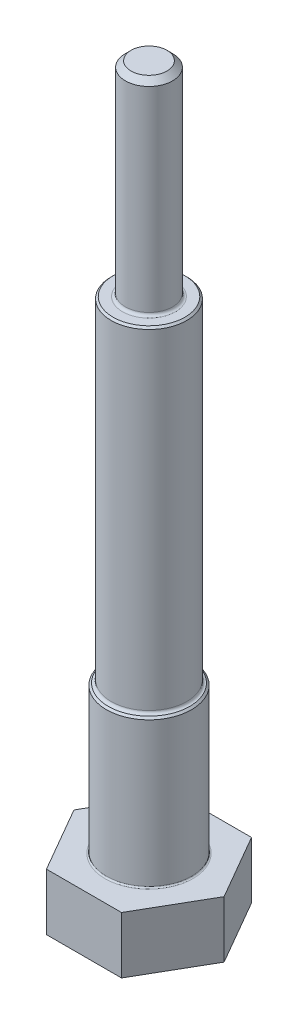
ISO-10303-21;
HEADER;
FILE_DESCRIPTION(('STEP AP214'),'2;1');
FILE_NAME('part.step','',(''),(''),'','','');
FILE_SCHEMA(('AUTOMOTIVE_DESIGN { 1 0 10303 214 1 1 1 1 }'));
ENDSEC;
DATA;
#1=APPLICATION_CONTEXT('core data for automotive mechanical design processes');
#2=APPLICATION_PROTOCOL_DEFINITION('international standard','automotive_design',2000,#1);
#3=PRODUCT_CONTEXT('',#1,'mechanical');
#4=PRODUCT('Part','Part','',(#3));
#5=PRODUCT_RELATED_PRODUCT_CATEGORY('part','',(#4));
#6=PRODUCT_DEFINITION_FORMATION('','',#4);
#7=PRODUCT_DEFINITION_CONTEXT('part definition',#1,'design');
#8=PRODUCT_DEFINITION('design','',#6,#7);
#9=PRODUCT_DEFINITION_SHAPE('','',#8);
#10=(LENGTH_UNIT() NAMED_UNIT(*) SI_UNIT(.MILLI.,.METRE.));
#11=(NAMED_UNIT(*) PLANE_ANGLE_UNIT() SI_UNIT($,.RADIAN.));
#12=(NAMED_UNIT(*) SI_UNIT($,.STERADIAN.) SOLID_ANGLE_UNIT());
#13=UNCERTAINTY_MEASURE_WITH_UNIT(LENGTH_MEASURE(1.E-05),#10,'distance_accuracy_value','');
#14=(GEOMETRIC_REPRESENTATION_CONTEXT(3) GLOBAL_UNCERTAINTY_ASSIGNED_CONTEXT((#13)) GLOBAL_UNIT_ASSIGNED_CONTEXT((#10,
#11,#12)) REPRESENTATION_CONTEXT('',''));
#15=CARTESIAN_POINT('',(0.,0.,0.));
#16=DIRECTION('',(0.,0.,1.));
#17=DIRECTION('',(1.,0.,0.));
#18=AXIS2_PLACEMENT_3D('',#15,#16,#17);
#19=CARTESIAN_POINT('',(0.,144.78,0.));
#20=DIRECTION('',(0.,1.,0.));
#21=DIRECTION('',(0.,0.,1.));
#22=AXIS2_PLACEMENT_3D('',#19,#20,#21);
#23=PLANE('',#22);
#24=CARTESIAN_POINT('',(0.,144.78,0.));
#25=DIRECTION('',(0.,1.,0.));
#26=DIRECTION('',(0.,0.,1.));
#27=AXIS2_PLACEMENT_3D('',#24,#25,#26);
#28=CIRCLE('',#27,9.65199999999997);
#29=CARTESIAN_POINT('',(0.,144.78,9.65199999999997));
#30=VERTEX_POINT('',#29);
#31=EDGE_CURVE('E55',#30,#30,#28,.T.);
#32=ORIENTED_EDGE('',*,*,#31,.T.);
#33=EDGE_LOOP('',(#32));
#34=FACE_BOUND('',#33,.T.);
#35=CARTESIAN_POINT('',(0.,144.78,0.));
#36=DIRECTION('',(0.,1.,0.));
#37=DIRECTION('',(0.,0.,1.));
#38=AXIS2_PLACEMENT_3D('',#35,#36,#37);
#39=CIRCLE('',#38,7.112);
#40=CARTESIAN_POINT('',(0.,144.78,7.112));
#41=VERTEX_POINT('',#40);
#42=EDGE_CURVE('E166',#41,#41,#39,.F.);
#43=ORIENTED_EDGE('',*,*,#42,.T.);
#44=EDGE_LOOP('',(#43));
#45=FACE_BOUND('',#44,.T.);
#46=ADVANCED_FACE('F46',(#34,#45),#23,.T.);
#47=CARTESIAN_POINT('',(10.0819790757238,15.24,17.4625));
#48=DIRECTION('',(0.,1.,0.));
#49=DIRECTION('',(0.,0.,1.));
#50=AXIS2_PLACEMENT_3D('',#47,#48,#49);
#51=PLANE('',#50);
#52=CARTESIAN_POINT('',(0.,15.24,0.));
#53=DIRECTION('',(0.,1.,0.));
#54=DIRECTION('',(0.,0.,1.));
#55=AXIS2_PLACEMENT_3D('',#52,#53,#54);
#56=CIRCLE('',#55,11.811);
#57=CARTESIAN_POINT('',(0.,15.24,11.811));
#58=VERTEX_POINT('',#57);
#59=EDGE_CURVE('E160',#58,#58,#56,.F.);
#60=ORIENTED_EDGE('',*,*,#59,.T.);
#61=EDGE_LOOP('',(#60));
#62=FACE_BOUND('',#61,.T.);
#63=DIRECTION('',(1.,0.,0.));
#64=VECTOR('',#63,1.);
#65=CARTESIAN_POINT('',(-10.0819790757238,15.24,17.4625));
#66=LINE('',#65,#64);
#67=CARTESIAN_POINT('',(-10.0819790757238,15.24,17.4625));
#68=VERTEX_POINT('',#67);
#69=CARTESIAN_POINT('',(10.0819790757238,15.24,17.4625));
#70=VERTEX_POINT('',#69);
#71=EDGE_CURVE('E142',#68,#70,#66,.T.);
#72=ORIENTED_EDGE('',*,*,#71,.T.);
#73=DIRECTION('',(0.5,0.,-0.866025403784439));
#74=VECTOR('',#73,1.);
#75=CARTESIAN_POINT('',(10.0819790757238,15.24,17.4625));
#76=LINE('',#75,#74);
#77=CARTESIAN_POINT('',(20.1639581514477,15.24,0.));
#78=VERTEX_POINT('',#77);
#79=EDGE_CURVE('E101',#70,#78,#76,.T.);
#80=ORIENTED_EDGE('',*,*,#79,.T.);
#81=DIRECTION('',(-0.5,0.,-0.866025403784439));
#82=VECTOR('',#81,1.);
#83=CARTESIAN_POINT('',(20.1639581514477,15.24,0.));
#84=LINE('',#83,#82);
#85=CARTESIAN_POINT('',(10.0819790757238,15.24,-17.4625));
#86=VERTEX_POINT('',#85);
#87=EDGE_CURVE('E114',#78,#86,#84,.T.);
#88=ORIENTED_EDGE('',*,*,#87,.T.);
#89=DIRECTION('',(-1.,0.,0.));
#90=VECTOR('',#89,1.);
#91=CARTESIAN_POINT('',(10.0819790757238,15.24,-17.4625));
#92=LINE('',#91,#90);
#93=CARTESIAN_POINT('',(-10.0819790757238,15.24,-17.4625));
#94=VERTEX_POINT('',#93);
#95=EDGE_CURVE('E108',#86,#94,#92,.T.);
#96=ORIENTED_EDGE('',*,*,#95,.T.);
#97=DIRECTION('',(-0.5,0.,0.866025403784439));
#98=VECTOR('',#97,1.);
#99=CARTESIAN_POINT('',(-10.0819790757238,15.24,-17.4625));
#100=LINE('',#99,#98);
#101=CARTESIAN_POINT('',(-20.1639581514477,15.24,0.));
#102=VERTEX_POINT('',#101);
#103=EDGE_CURVE('E112',#94,#102,#100,.T.);
#104=ORIENTED_EDGE('',*,*,#103,.T.);
#105=DIRECTION('',(0.5,0.,0.866025403784439));
#106=VECTOR('',#105,1.);
#107=CARTESIAN_POINT('',(-20.1639581514477,15.24,0.));
#108=LINE('',#107,#106);
#109=EDGE_CURVE('E63',#102,#68,#108,.T.);
#110=ORIENTED_EDGE('',*,*,#109,.T.);
#111=EDGE_LOOP('',(#72,#80,#88,#96,#104,#110));
#112=FACE_BOUND('',#111,.T.);
#113=ADVANCED_FACE('F110',(#62,#112),#51,.T.);
#114=CARTESIAN_POINT('',(-10.0819790757238,15.24,17.4625));
#115=DIRECTION('',(0.,0.,-1.));
#116=DIRECTION('',(-1.,0.,0.));
#117=AXIS2_PLACEMENT_3D('',#114,#115,#116);
#118=PLANE('',#117);
#119=DIRECTION('',(1.,0.,0.));
#120=VECTOR('',#119,1.);
#121=CARTESIAN_POINT('',(-10.0819790757238,0.,17.4625));
#122=LINE('',#121,#120);
#123=CARTESIAN_POINT('',(-10.0819790757238,0.,17.4625));
#124=VERTEX_POINT('',#123);
#125=CARTESIAN_POINT('',(10.0819790757238,0.,17.4625));
#126=VERTEX_POINT('',#125);
#127=EDGE_CURVE('E132',#124,#126,#122,.T.);
#128=ORIENTED_EDGE('',*,*,#127,.T.);
#129=DIRECTION('',(0.,-1.,0.));
#130=VECTOR('',#129,1.);
#131=CARTESIAN_POINT('',(10.0819790757238,15.24,17.4625));
#132=LINE('',#131,#130);
#133=EDGE_CURVE('E149',#70,#126,#132,.T.);
#134=ORIENTED_EDGE('',*,*,#133,.F.);
#135=ORIENTED_EDGE('',*,*,#71,.F.);
#136=DIRECTION('',(0.,-1.,0.));
#137=VECTOR('',#136,1.);
#138=CARTESIAN_POINT('',(-10.0819790757238,15.24,17.4625));
#139=LINE('',#138,#137);
#140=EDGE_CURVE('E128',#68,#124,#139,.T.);
#141=ORIENTED_EDGE('',*,*,#140,.T.);
#142=EDGE_LOOP('',(#128,#134,#135,#141));
#143=FACE_BOUND('',#142,.T.);
#144=ADVANCED_FACE('F196',(#143),#118,.F.);
#145=CARTESIAN_POINT('',(10.0819790757238,15.24,17.4625));
#146=DIRECTION('',(-0.866025403784439,0.,-0.5));
#147=DIRECTION('',(-0.5,0.,0.866025403784439));
#148=AXIS2_PLACEMENT_3D('',#145,#146,#147);
#149=PLANE('',#148);
#150=DIRECTION('',(0.5,0.,-0.866025403784439));
#151=VECTOR('',#150,1.);
#152=CARTESIAN_POINT('',(10.0819790757238,0.,17.4625));
#153=LINE('',#152,#151);
#154=CARTESIAN_POINT('',(20.1639581514477,0.,0.));
#155=VERTEX_POINT('',#154);
#156=EDGE_CURVE('E135',#126,#155,#153,.T.);
#157=ORIENTED_EDGE('',*,*,#156,.T.);
#158=DIRECTION('',(0.,-1.,0.));
#159=VECTOR('',#158,1.);
#160=CARTESIAN_POINT('',(20.1639581514477,15.24,0.));
#161=LINE('',#160,#159);
#162=EDGE_CURVE('E146',#78,#155,#161,.T.);
#163=ORIENTED_EDGE('',*,*,#162,.F.);
#164=ORIENTED_EDGE('',*,*,#79,.F.);
#165=ORIENTED_EDGE('',*,*,#133,.T.);
#166=EDGE_LOOP('',(#157,#163,#164,#165));
#167=FACE_BOUND('',#166,.T.);
#168=ADVANCED_FACE('F225',(#167),#149,.F.);
#169=CARTESIAN_POINT('',(20.1639581514477,15.24,0.));
#170=DIRECTION('',(-0.866025403784439,0.,0.5));
#171=DIRECTION('',(0.5,0.,0.866025403784439));
#172=AXIS2_PLACEMENT_3D('',#169,#170,#171);
#173=PLANE('',#172);
#174=DIRECTION('',(-0.5,0.,-0.866025403784439));
#175=VECTOR('',#174,1.);
#176=CARTESIAN_POINT('',(20.1639581514477,0.,0.));
#177=LINE('',#176,#175);
#178=CARTESIAN_POINT('',(10.0819790757238,0.,-17.4625));
#179=VERTEX_POINT('',#178);
#180=EDGE_CURVE('E137',#155,#179,#177,.T.);
#181=ORIENTED_EDGE('',*,*,#180,.T.);
#182=DIRECTION('',(0.,-1.,0.));
#183=VECTOR('',#182,1.);
#184=CARTESIAN_POINT('',(10.0819790757238,15.24,-17.4625));
#185=LINE('',#184,#183);
#186=EDGE_CURVE('E123',#86,#179,#185,.T.);
#187=ORIENTED_EDGE('',*,*,#186,.F.);
#188=ORIENTED_EDGE('',*,*,#87,.F.);
#189=ORIENTED_EDGE('',*,*,#162,.T.);
#190=EDGE_LOOP('',(#181,#187,#188,#189));
#191=FACE_BOUND('',#190,.T.);
#192=ADVANCED_FACE('F222',(#191),#173,.F.);
#193=CARTESIAN_POINT('',(10.0819790757238,15.24,-17.4625));
#194=DIRECTION('',(0.,0.,1.));
#195=DIRECTION('',(1.,0.,0.));
#196=AXIS2_PLACEMENT_3D('',#193,#194,#195);
#197=PLANE('',#196);
#198=DIRECTION('',(-1.,0.,0.));
#199=VECTOR('',#198,1.);
#200=CARTESIAN_POINT('',(10.0819790757238,0.,-17.4625));
#201=LINE('',#200,#199);
#202=CARTESIAN_POINT('',(-10.0819790757238,0.,-17.4625));
#203=VERTEX_POINT('',#202);
#204=EDGE_CURVE('E122',#179,#203,#201,.T.);
#205=ORIENTED_EDGE('',*,*,#204,.T.);
#206=DIRECTION('',(0.,-1.,0.));
#207=VECTOR('',#206,1.);
#208=CARTESIAN_POINT('',(-10.0819790757238,15.24,-17.4625));
#209=LINE('',#208,#207);
#210=EDGE_CURVE('E119',#94,#203,#209,.T.);
#211=ORIENTED_EDGE('',*,*,#210,.F.);
#212=ORIENTED_EDGE('',*,*,#95,.F.);
#213=ORIENTED_EDGE('',*,*,#186,.T.);
#214=EDGE_LOOP('',(#205,#211,#212,#213));
#215=FACE_BOUND('',#214,.T.);
#216=ADVANCED_FACE('F120',(#215),#197,.F.);
#217=CARTESIAN_POINT('',(-10.0819790757238,15.24,-17.4625));
#218=DIRECTION('',(0.866025403784439,0.,0.5));
#219=DIRECTION('',(0.5,0.,-0.866025403784439));
#220=AXIS2_PLACEMENT_3D('',#217,#218,#219);
#221=PLANE('',#220);
#222=DIRECTION('',(-0.5,0.,0.866025403784439));
#223=VECTOR('',#222,1.);
#224=CARTESIAN_POINT('',(-10.0819790757238,0.,-17.4625));
#225=LINE('',#224,#223);
#226=CARTESIAN_POINT('',(-20.1639581514477,0.,0.));
#227=VERTEX_POINT('',#226);
#228=EDGE_CURVE('E86',#203,#227,#225,.T.);
#229=ORIENTED_EDGE('',*,*,#228,.T.);
#230=DIRECTION('',(0.,-1.,0.));
#231=VECTOR('',#230,1.);
#232=CARTESIAN_POINT('',(-20.1639581514477,15.24,0.));
#233=LINE('',#232,#231);
#234=EDGE_CURVE('E124',#102,#227,#233,.T.);
#235=ORIENTED_EDGE('',*,*,#234,.F.);
#236=ORIENTED_EDGE('',*,*,#103,.F.);
#237=ORIENTED_EDGE('',*,*,#210,.T.);
#238=EDGE_LOOP('',(#229,#235,#236,#237));
#239=FACE_BOUND('',#238,.T.);
#240=ADVANCED_FACE('F126',(#239),#221,.F.);
#241=CARTESIAN_POINT('',(-20.1639581514477,15.24,0.));
#242=DIRECTION('',(0.866025403784439,0.,-0.5));
#243=DIRECTION('',(-0.5,0.,-0.866025403784439));
#244=AXIS2_PLACEMENT_3D('',#241,#242,#243);
#245=PLANE('',#244);
#246=DIRECTION('',(0.5,0.,0.866025403784439));
#247=VECTOR('',#246,1.);
#248=CARTESIAN_POINT('',(-20.1639581514477,0.,0.));
#249=LINE('',#248,#247);
#250=EDGE_CURVE('E92',#227,#124,#249,.T.);
#251=ORIENTED_EDGE('',*,*,#250,.T.);
#252=ORIENTED_EDGE('',*,*,#140,.F.);
#253=ORIENTED_EDGE('',*,*,#109,.F.);
#254=ORIENTED_EDGE('',*,*,#234,.T.);
#255=EDGE_LOOP('',(#251,#252,#253,#254));
#256=FACE_BOUND('',#255,.T.);
#257=ADVANCED_FACE('F214',(#256),#245,.F.);
#258=CARTESIAN_POINT('',(10.0819790757238,0.,17.4625));
#259=DIRECTION('',(0.,1.,0.));
#260=DIRECTION('',(0.,0.,1.));
#261=AXIS2_PLACEMENT_3D('',#258,#259,#260);
#262=PLANE('',#261);
#263=ORIENTED_EDGE('',*,*,#127,.F.);
#264=ORIENTED_EDGE('',*,*,#250,.F.);
#265=ORIENTED_EDGE('',*,*,#228,.F.);
#266=ORIENTED_EDGE('',*,*,#204,.F.);
#267=ORIENTED_EDGE('',*,*,#180,.F.);
#268=ORIENTED_EDGE('',*,*,#156,.F.);
#269=EDGE_LOOP('',(#263,#264,#265,#266,#267,#268));
#270=FACE_BOUND('',#269,.T.);
#271=ADVANCED_FACE('F209',(#270),#262,.F.);
#272=CARTESIAN_POINT('',(0.,54.864,0.));
#273=DIRECTION('',(0.,-1.,0.));
#274=DIRECTION('',(0.,0.,-1.));
#275=AXIS2_PLACEMENT_3D('',#272,#273,#274);
#276=CYLINDRICAL_SURFACE('',#275,11.43);
#277=CARTESIAN_POINT('',(0.,54.356,0.));
#278=DIRECTION('',(0.,1.,0.));
#279=DIRECTION('',(0.,0.,1.));
#280=AXIS2_PLACEMENT_3D('',#277,#278,#279);
#281=CIRCLE('',#280,11.43);
#282=CARTESIAN_POINT('',(0.,54.356,11.43));
#283=VERTEX_POINT('',#282);
#284=EDGE_CURVE('E175',#283,#283,#281,.F.);
#285=ORIENTED_EDGE('',*,*,#284,.T.);
#286=EDGE_LOOP('',(#285));
#287=FACE_BOUND('',#286,.T.);
#288=CARTESIAN_POINT('',(0.,15.621,0.));
#289=DIRECTION('',(0.,1.,0.));
#290=DIRECTION('',(0.,0.,1.));
#291=AXIS2_PLACEMENT_3D('',#288,#289,#290);
#292=CIRCLE('',#291,11.43);
#293=CARTESIAN_POINT('',(0.,15.621,11.43));
#294=VERTEX_POINT('',#293);
#295=EDGE_CURVE('E157',#294,#294,#292,.T.);
#296=ORIENTED_EDGE('',*,*,#295,.T.);
#297=EDGE_LOOP('',(#296));
#298=FACE_BOUND('',#297,.T.);
#299=ADVANCED_FACE('F206',(#287,#298),#276,.T.);
#300=CARTESIAN_POINT('',(0.,144.78,0.));
#301=DIRECTION('',(0.,-1.,0.));
#302=DIRECTION('',(0.,0.,-1.));
#303=AXIS2_PLACEMENT_3D('',#300,#301,#302);
#304=CYLINDRICAL_SURFACE('',#303,10.16);
#305=CARTESIAN_POINT('',(0.,144.272,0.));
#306=DIRECTION('',(0.,1.,0.));
#307=DIRECTION('',(0.,0.,1.));
#308=AXIS2_PLACEMENT_3D('',#305,#306,#307);
#309=CIRCLE('',#308,10.16);
#310=CARTESIAN_POINT('',(0.,144.272,10.16));
#311=VERTEX_POINT('',#310);
#312=EDGE_CURVE('E12',#311,#311,#309,.F.);
#313=ORIENTED_EDGE('',*,*,#312,.T.);
#314=EDGE_LOOP('',(#313));
#315=FACE_BOUND('',#314,.T.);
#316=CARTESIAN_POINT('',(0.,55.626,0.));
#317=DIRECTION('',(0.,1.,0.));
#318=DIRECTION('',(0.,0.,1.));
#319=AXIS2_PLACEMENT_3D('',#316,#317,#318);
#320=CIRCLE('',#319,10.16);
#321=CARTESIAN_POINT('',(0.,55.626,10.16));
#322=VERTEX_POINT('',#321);
#323=EDGE_CURVE('E169',#322,#322,#320,.T.);
#324=ORIENTED_EDGE('',*,*,#323,.T.);
#325=EDGE_LOOP('',(#324));
#326=FACE_BOUND('',#325,.T.);
#327=ADVANCED_FACE('F203',(#315,#326),#304,.T.);
#328=CARTESIAN_POINT('',(0.,199.644,0.));
#329=DIRECTION('',(0.,-1.,0.));
#330=DIRECTION('',(0.,0.,-1.));
#331=AXIS2_PLACEMENT_3D('',#328,#329,#330);
#332=CYLINDRICAL_SURFACE('',#331,6.35);
#333=CARTESIAN_POINT('',(0.,145.542,0.));
#334=DIRECTION('',(0.,1.,0.));
#335=DIRECTION('',(0.,0.,1.));
#336=AXIS2_PLACEMENT_3D('',#333,#334,#335);
#337=CIRCLE('',#336,6.35);
#338=CARTESIAN_POINT('',(0.,145.542,6.35));
#339=VERTEX_POINT('',#338);
#340=EDGE_CURVE('E163',#339,#339,#337,.T.);
#341=ORIENTED_EDGE('',*,*,#340,.T.);
#342=EDGE_LOOP('',(#341));
#343=FACE_BOUND('',#342,.T.);
#344=CARTESIAN_POINT('',(0.,198.12,0.));
#345=DIRECTION('',(0.,1.,0.));
#346=DIRECTION('',(0.,0.,1.));
#347=AXIS2_PLACEMENT_3D('',#344,#345,#346);
#348=CIRCLE('',#347,6.35);
#349=CARTESIAN_POINT('',(0.,198.12,-6.35000000000001));
#350=VERTEX_POINT('',#349);
#351=EDGE_CURVE('E154',#350,#350,#348,.F.);
#352=ORIENTED_EDGE('',*,*,#351,.T.);
#353=EDGE_LOOP('',(#352));
#354=FACE_BOUND('',#353,.T.);
#355=ADVANCED_FACE('F201',(#343,#354),#332,.T.);
#356=CARTESIAN_POINT('',(0.,199.644,0.));
#357=DIRECTION('',(0.,1.,0.));
#358=DIRECTION('',(0.,0.,1.));
#359=AXIS2_PLACEMENT_3D('',#356,#357,#358);
#360=PLANE('',#359);
#361=CARTESIAN_POINT('',(0.,199.644,0.));
#362=DIRECTION('',(0.,1.,0.));
#363=DIRECTION('',(0.,0.,1.));
#364=AXIS2_PLACEMENT_3D('',#361,#362,#363);
#365=CIRCLE('',#364,4.826);
#366=CARTESIAN_POINT('',(0.,199.644,-4.82600000000001));
#367=VERTEX_POINT('',#366);
#368=EDGE_CURVE('E151',#367,#367,#365,.T.);
#369=ORIENTED_EDGE('',*,*,#368,.T.);
#370=EDGE_LOOP('',(#369));
#371=FACE_BOUND('',#370,.T.);
#372=ADVANCED_FACE('F236',(#371),#360,.T.);
#373=CARTESIAN_POINT('',(0.,199.644,0.));
#374=DIRECTION('',(0.,-1.,0.));
#375=DIRECTION('',(0.,0.,-1.));
#376=AXIS2_PLACEMENT_3D('',#373,#374,#375);
#377=CONICAL_SURFACE('',#376,4.826,0.785398163397441);
#378=CARTESIAN_POINT('',(0.,198.12,-6.35000000000001));
#379=CARTESIAN_POINT('',(0.,198.135875,-6.33412500000002));
#380=CARTESIAN_POINT('',(0.,198.15175,-6.31825000000002));
#381=CARTESIAN_POINT('',(0.,198.1835,-6.28650000000002));
#382=CARTESIAN_POINT('',(0.,198.199375,-6.27062500000001));
#383=CARTESIAN_POINT('',(0.,198.231125,-6.23887500000001));
#384=CARTESIAN_POINT('',(0.,198.247,-6.22300000000001));
#385=CARTESIAN_POINT('',(0.,198.27875,-6.19125000000001));
#386=CARTESIAN_POINT('',(0.,198.294625,-6.17537500000001));
#387=CARTESIAN_POINT('',(0.,198.326375,-6.14362500000001));
#388=CARTESIAN_POINT('',(0.,198.34225,-6.12775000000001));
#389=CARTESIAN_POINT('',(0.,198.374,-6.09600000000001));
#390=CARTESIAN_POINT('',(0.,198.389875,-6.08012500000001));
#391=CARTESIAN_POINT('',(0.,198.421625,-6.04837500000002));
#392=CARTESIAN_POINT('',(0.,198.4375,-6.03250000000001));
#393=CARTESIAN_POINT('',(0.,198.46925,-6.00075000000001));
#394=CARTESIAN_POINT('',(0.,198.485125,-5.98487500000001));
#395=CARTESIAN_POINT('',(0.,198.516875,-5.95312500000001));
#396=CARTESIAN_POINT('',(0.,198.53275,-5.93725000000001));
#397=CARTESIAN_POINT('',(0.,198.5645,-5.90550000000001));
#398=CARTESIAN_POINT('',(0.,198.580375,-5.88962500000001));
#399=CARTESIAN_POINT('',(0.,198.612125,-5.85787500000001));
#400=CARTESIAN_POINT('',(0.,198.628,-5.84200000000001));
#401=CARTESIAN_POINT('',(0.,198.65975,-5.81025000000002));
#402=CARTESIAN_POINT('',(0.,198.675625,-5.79437500000001));
#403=CARTESIAN_POINT('',(0.,198.707375,-5.76262500000001));
#404=CARTESIAN_POINT('',(0.,198.72325,-5.74675000000001));
#405=CARTESIAN_POINT('',(0.,198.755,-5.71500000000001));
#406=CARTESIAN_POINT('',(0.,198.770875,-5.69912500000001));
#407=CARTESIAN_POINT('',(0.,198.802625,-5.66737500000001));
#408=CARTESIAN_POINT('',(0.,198.8185,-5.65150000000001));
#409=CARTESIAN_POINT('',(0.,198.85025,-5.61975000000001));
#410=CARTESIAN_POINT('',(0.,198.866125,-5.60387500000001));
#411=CARTESIAN_POINT('',(0.,198.897875,-5.57212500000001));
#412=CARTESIAN_POINT('',(0.,198.91375,-5.55625000000001));
#413=CARTESIAN_POINT('',(0.,198.9455,-5.52450000000002));
#414=CARTESIAN_POINT('',(0.,198.961375,-5.50862500000001));
#415=CARTESIAN_POINT('',(0.,198.993125,-5.47687500000001));
#416=CARTESIAN_POINT('',(0.,199.009,-5.46100000000001));
#417=CARTESIAN_POINT('',(0.,199.04075,-5.42925000000001));
#418=CARTESIAN_POINT('',(0.,199.056625,-5.41337500000001));
#419=CARTESIAN_POINT('',(0.,199.088375,-5.38162500000001));
#420=CARTESIAN_POINT('',(0.,199.10425,-5.36575000000001));
#421=CARTESIAN_POINT('',(0.,199.136,-5.33400000000001));
#422=CARTESIAN_POINT('',(0.,199.151875,-5.31812500000001));
#423=CARTESIAN_POINT('',(0.,199.183625,-5.28637500000001));
#424=CARTESIAN_POINT('',(0.,199.1995,-5.27050000000001));
#425=CARTESIAN_POINT('',(0.,199.23125,-5.23875000000001));
#426=CARTESIAN_POINT('',(0.,199.247125,-5.22287500000001));
#427=CARTESIAN_POINT('',(0.,199.278875,-5.19112500000001));
#428=CARTESIAN_POINT('',(0.,199.29475,-5.17525000000001));
#429=CARTESIAN_POINT('',(0.,199.3265,-5.14350000000001));
#430=CARTESIAN_POINT('',(0.,199.342375,-5.12762500000001));
#431=CARTESIAN_POINT('',(0.,199.374125,-5.09587500000001));
#432=CARTESIAN_POINT('',(0.,199.39,-5.08000000000001));
#433=CARTESIAN_POINT('',(0.,199.42175,-5.04825000000001));
#434=CARTESIAN_POINT('',(0.,199.437625,-5.03237500000001));
#435=CARTESIAN_POINT('',(0.,199.469375,-5.00062500000001));
#436=CARTESIAN_POINT('',(0.,199.48525,-4.98475000000001));
#437=CARTESIAN_POINT('',(0.,199.517,-4.95300000000001));
#438=CARTESIAN_POINT('',(0.,199.532875,-4.93712500000001));
#439=CARTESIAN_POINT('',(0.,199.564625,-4.90537500000001));
#440=CARTESIAN_POINT('',(0.,199.5805,-4.88950000000001));
#441=CARTESIAN_POINT('',(0.,199.61225,-4.85775000000001));
#442=CARTESIAN_POINT('',(0.,199.628125,-4.84187500000001));
#443=CARTESIAN_POINT('',(0.,199.644,-4.82600000000001));
#444=B_SPLINE_CURVE_WITH_KNOTS('',3,(#378,#379,#380,#381,#382,#383,#384,#385,#386,#387,#388,
#389,#390,#391,#392,#393,#394,#395,#396,#397,#398,#399,#400,#401,#402,#403,#404,#405,#406,#407,
#408,#409,#410,#411,#412,#413,#414,#415,#416,#417,#418,#419,#420,#421,#422,#423,#424,#425,#426,
#427,#428,#429,#430,#431,#432,#433,#434,#435,#436,#437,#438,#439,#440,#441,#442,#443),
.UNSPECIFIED.,.F.,.F.,(4,2,2,2,2,2,2,2,2,2,2,2,2,2,2,2,2,2,2,2,2,2,2,2,2,2,2,2,2,2,2,2,4),(0.,
0.0673519209080351,0.134703841816051,0.202055762724066,0.269407683632082,0.336759604540098,
0.404111525448133,0.471463446356148,0.538815367264164,0.606167288172179,0.673519209080195,
0.74087112998823,0.808223050896246,0.875574971804261,0.942926892712277,1.01027881362029,
1.07763073452831,1.14498265543634,1.21233457634436,1.27968649725237,1.34703841816039,
1.41439033906841,1.48174225997644,1.54909418088446,1.61644610179247,1.68379802270049,
1.7511499436085,1.81850186451654,1.88585378542455,1.95320570633257,2.02055762724059,
2.0879095481486,2.15526146905664),.UNSPECIFIED.);
#445=EDGE_CURVE('BSEAM232',#350,#367,#444,.T.);
#446=ORIENTED_EDGE('',*,*,#351,.F.);
#447=ORIENTED_EDGE('',*,*,#368,.F.);
#448=ORIENTED_EDGE('',*,*,#445,.T.);
#449=ORIENTED_EDGE('',*,*,#445,.F.);
#450=EDGE_LOOP('',(#446,#448,#447,#449));
#451=FACE_BOUND('',#450,.T.);
#452=ADVANCED_FACE('F232',(#451),#377,.T.);
#453=CARTESIAN_POINT('',(0.,15.621,0.));
#454=DIRECTION('',(0.,1.,0.));
#455=DIRECTION('',(0.,0.,1.));
#456=AXIS2_PLACEMENT_3D('',#453,#454,#455);
#457=TOROIDAL_SURFACE('',#456,11.811,0.381);
#458=ORIENTED_EDGE('',*,*,#59,.F.);
#459=EDGE_LOOP('',(#458));
#460=FACE_BOUND('',#459,.T.);
#461=ORIENTED_EDGE('',*,*,#295,.F.);
#462=EDGE_LOOP('',(#461));
#463=FACE_BOUND('',#462,.T.);
#464=ADVANCED_FACE('F235',(#460,#463),#457,.F.);
#465=CARTESIAN_POINT('',(0.,145.542,0.));
#466=DIRECTION('',(0.,1.,0.));
#467=DIRECTION('',(0.,0.,1.));
#468=AXIS2_PLACEMENT_3D('',#465,#466,#467);
#469=TOROIDAL_SURFACE('',#468,7.112,0.762);
#470=ORIENTED_EDGE('',*,*,#42,.F.);
#471=EDGE_LOOP('',(#470));
#472=FACE_BOUND('',#471,.T.);
#473=ORIENTED_EDGE('',*,*,#340,.F.);
#474=EDGE_LOOP('',(#473));
#475=FACE_BOUND('',#474,.T.);
#476=ADVANCED_FACE('F240',(#472,#475),#469,.F.);
#477=CARTESIAN_POINT('',(0.,55.626,0.));
#478=DIRECTION('',(0.,1.,0.));
#479=DIRECTION('',(0.,0.,1.));
#480=AXIS2_PLACEMENT_3D('',#477,#478,#479);
#481=TOROIDAL_SURFACE('',#480,10.922,0.762);
#482=CARTESIAN_POINT('',(0.,54.864,0.));
#483=DIRECTION('',(0.,1.,0.));
#484=DIRECTION('',(0.,0.,1.));
#485=AXIS2_PLACEMENT_3D('',#482,#483,#484);
#486=CIRCLE('',#485,10.922);
#487=CARTESIAN_POINT('',(0.,54.864,10.922));
#488=VERTEX_POINT('',#487);
#489=EDGE_CURVE('E172',#488,#488,#486,.F.);
#490=ORIENTED_EDGE('',*,*,#489,.F.);
#491=EDGE_LOOP('',(#490));
#492=FACE_BOUND('',#491,.T.);
#493=ORIENTED_EDGE('',*,*,#323,.F.);
#494=EDGE_LOOP('',(#493));
#495=FACE_BOUND('',#494,.T.);
#496=ADVANCED_FACE('F188',(#492,#495),#481,.F.);
#497=CARTESIAN_POINT('',(0.,54.864,0.));
#498=DIRECTION('',(0.,-1.,0.));
#499=DIRECTION('',(0.,0.,-1.));
#500=AXIS2_PLACEMENT_3D('',#497,#498,#499);
#501=CONICAL_SURFACE('',#500,10.922,0.785398163397467);
#502=ORIENTED_EDGE('',*,*,#284,.F.);
#503=EDGE_LOOP('',(#502));
#504=FACE_BOUND('',#503,.T.);
#505=ORIENTED_EDGE('',*,*,#489,.T.);
#506=EDGE_LOOP('',(#505));
#507=FACE_BOUND('',#506,.T.);
#508=ADVANCED_FACE('F183',(#504,#507),#501,.T.);
#509=CARTESIAN_POINT('',(0.,144.78,0.));
#510=DIRECTION('',(0.,-1.,0.));
#511=DIRECTION('',(0.,0.,-1.));
#512=AXIS2_PLACEMENT_3D('',#509,#510,#511);
#513=CONICAL_SURFACE('',#512,9.65199999999997,0.785398163397447);
#514=ORIENTED_EDGE('',*,*,#312,.F.);
#515=EDGE_LOOP('',(#514));
#516=FACE_BOUND('',#515,.T.);
#517=ORIENTED_EDGE('',*,*,#31,.F.);
#518=EDGE_LOOP('',(#517));
#519=FACE_BOUND('',#518,.T.);
#520=ADVANCED_FACE('F48',(#516,#519),#513,.T.);
#521=CLOSED_SHELL('',(#46,#113,#144,#168,#192,#216,#240,#257,#271,#299,#327,#355,#372,#452,#464,
#476,#496,#508,#520));
#522=MANIFOLD_SOLID_BREP('B2',#521);
#523=ADVANCED_BREP_SHAPE_REPRESENTATION('',(#18,#522),#14);
#524=SHAPE_DEFINITION_REPRESENTATION(#9,#523);
ENDSEC;
END-ISO-10303-21;
